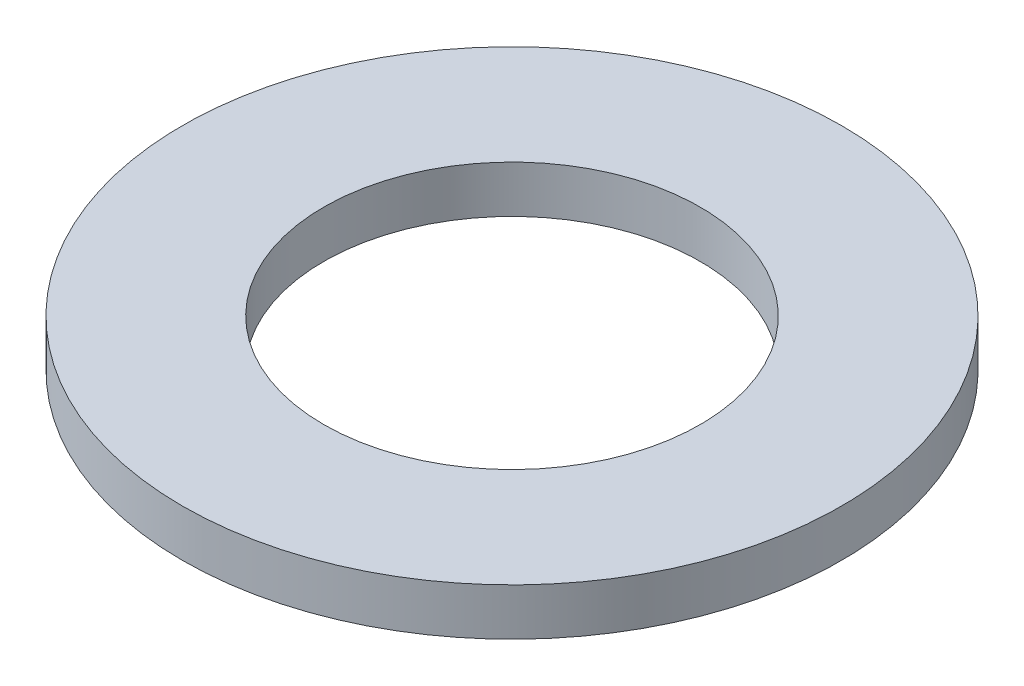
ISO-10303-21;
HEADER;
FILE_DESCRIPTION(('STEP AP214'),'2;1');
FILE_NAME('part.step','',(''),(''),'','','');
FILE_SCHEMA(('AUTOMOTIVE_DESIGN { 1 0 10303 214 1 1 1 1 }'));
ENDSEC;
DATA;
#1=APPLICATION_CONTEXT('core data for automotive mechanical design processes');
#2=APPLICATION_PROTOCOL_DEFINITION('international standard','automotive_design',2000,#1);
#3=PRODUCT_CONTEXT('',#1,'mechanical');
#4=PRODUCT('Part','Part','',(#3));
#5=PRODUCT_RELATED_PRODUCT_CATEGORY('part','',(#4));
#6=PRODUCT_DEFINITION_FORMATION('','',#4);
#7=PRODUCT_DEFINITION_CONTEXT('part definition',#1,'design');
#8=PRODUCT_DEFINITION('design','',#6,#7);
#9=PRODUCT_DEFINITION_SHAPE('','',#8);
#10=(LENGTH_UNIT() NAMED_UNIT(*) SI_UNIT(.MILLI.,.METRE.));
#11=(NAMED_UNIT(*) PLANE_ANGLE_UNIT() SI_UNIT($,.RADIAN.));
#12=(NAMED_UNIT(*) SI_UNIT($,.STERADIAN.) SOLID_ANGLE_UNIT());
#13=UNCERTAINTY_MEASURE_WITH_UNIT(LENGTH_MEASURE(1.E-05),#10,'distance_accuracy_value','');
#14=(GEOMETRIC_REPRESENTATION_CONTEXT(3) GLOBAL_UNCERTAINTY_ASSIGNED_CONTEXT((#13)) GLOBAL_UNIT_ASSIGNED_CONTEXT((#10,
#11,#12)) REPRESENTATION_CONTEXT('',''));
#15=CARTESIAN_POINT('',(0.,0.,0.));
#16=DIRECTION('',(0.,0.,1.));
#17=DIRECTION('',(1.,0.,0.));
#18=AXIS2_PLACEMENT_3D('',#15,#16,#17);
#19=CARTESIAN_POINT('',(0.,10.,0.));
#20=DIRECTION('',(0.,-1.,0.));
#21=DIRECTION('',(0.,0.,-1.));
#22=AXIS2_PLACEMENT_3D('',#19,#20,#21);
#23=CYLINDRICAL_SURFACE('',#22,70.);
#24=CARTESIAN_POINT('',(0.,10.,0.));
#25=DIRECTION('',(0.,1.,0.));
#26=DIRECTION('',(0.,0.,1.));
#27=AXIS2_PLACEMENT_3D('',#24,#25,#26);
#28=CIRCLE('',#27,70.);
#29=CARTESIAN_POINT('',(0.,10.,70.));
#30=VERTEX_POINT('',#29);
#31=EDGE_CURVE('E10',#30,#30,#28,.T.);
#32=ORIENTED_EDGE('',*,*,#31,.F.);
#33=EDGE_LOOP('',(#32));
#34=FACE_BOUND('',#33,.T.);
#35=CARTESIAN_POINT('',(0.,0.,0.));
#36=DIRECTION('',(0.,1.,0.));
#37=DIRECTION('',(0.,0.,1.));
#38=AXIS2_PLACEMENT_3D('',#35,#36,#37);
#39=CIRCLE('',#38,70.);
#40=CARTESIAN_POINT('',(0.,0.,70.));
#41=VERTEX_POINT('',#40);
#42=EDGE_CURVE('E37',#41,#41,#39,.T.);
#43=ORIENTED_EDGE('',*,*,#42,.T.);
#44=EDGE_LOOP('',(#43));
#45=FACE_BOUND('',#44,.T.);
#46=ADVANCED_FACE('F40',(#34,#45),#23,.T.);
#47=CARTESIAN_POINT('',(0.,10.,0.));
#48=DIRECTION('',(0.,1.,0.));
#49=DIRECTION('',(0.,0.,1.));
#50=AXIS2_PLACEMENT_3D('',#47,#48,#49);
#51=PLANE('',#50);
#52=CARTESIAN_POINT('',(0.,10.,0.));
#53=DIRECTION('',(0.,1.,0.));
#54=DIRECTION('',(0.,0.,1.));
#55=AXIS2_PLACEMENT_3D('',#52,#53,#54);
#56=CIRCLE('',#55,40.);
#57=CARTESIAN_POINT('',(0.,10.,40.));
#58=VERTEX_POINT('',#57);
#59=EDGE_CURVE('E50',#58,#58,#56,.T.);
#60=ORIENTED_EDGE('',*,*,#59,.F.);
#61=EDGE_LOOP('',(#60));
#62=FACE_BOUND('',#61,.T.);
#63=ORIENTED_EDGE('',*,*,#31,.T.);
#64=EDGE_LOOP('',(#63));
#65=FACE_BOUND('',#64,.T.);
#66=ADVANCED_FACE('F59',(#62,#65),#51,.T.);
#67=CARTESIAN_POINT('',(0.,0.,0.));
#68=DIRECTION('',(0.,1.,0.));
#69=DIRECTION('',(0.,0.,1.));
#70=AXIS2_PLACEMENT_3D('',#67,#68,#69);
#71=PLANE('',#70);
#72=CARTESIAN_POINT('',(0.,0.,0.));
#73=DIRECTION('',(0.,1.,0.));
#74=DIRECTION('',(0.,0.,1.));
#75=AXIS2_PLACEMENT_3D('',#72,#73,#74);
#76=CIRCLE('',#75,40.);
#77=CARTESIAN_POINT('',(0.,0.,40.));
#78=VERTEX_POINT('',#77);
#79=EDGE_CURVE('E47',#78,#78,#76,.T.);
#80=ORIENTED_EDGE('',*,*,#79,.T.);
#81=EDGE_LOOP('',(#80));
#82=FACE_BOUND('',#81,.T.);
#83=ORIENTED_EDGE('',*,*,#42,.F.);
#84=EDGE_LOOP('',(#83));
#85=FACE_BOUND('',#84,.T.);
#86=ADVANCED_FACE('F58',(#82,#85),#71,.F.);
#87=CARTESIAN_POINT('',(0.,10.,0.));
#88=DIRECTION('',(0.,-1.,0.));
#89=DIRECTION('',(0.,0.,-1.));
#90=AXIS2_PLACEMENT_3D('',#87,#88,#89);
#91=CYLINDRICAL_SURFACE('',#90,40.);
#92=ORIENTED_EDGE('',*,*,#59,.T.);
#93=EDGE_LOOP('',(#92));
#94=FACE_BOUND('',#93,.T.);
#95=ORIENTED_EDGE('',*,*,#79,.F.);
#96=EDGE_LOOP('',(#95));
#97=FACE_BOUND('',#96,.T.);
#98=ADVANCED_FACE('F54',(#94,#97),#91,.F.);
#99=CLOSED_SHELL('',(#46,#66,#86,#98));
#100=MANIFOLD_SOLID_BREP('B2',#99);
#101=ADVANCED_BREP_SHAPE_REPRESENTATION('',(#18,#100),#14);
#102=SHAPE_DEFINITION_REPRESENTATION(#9,#101);
ENDSEC;
END-ISO-10303-21;
